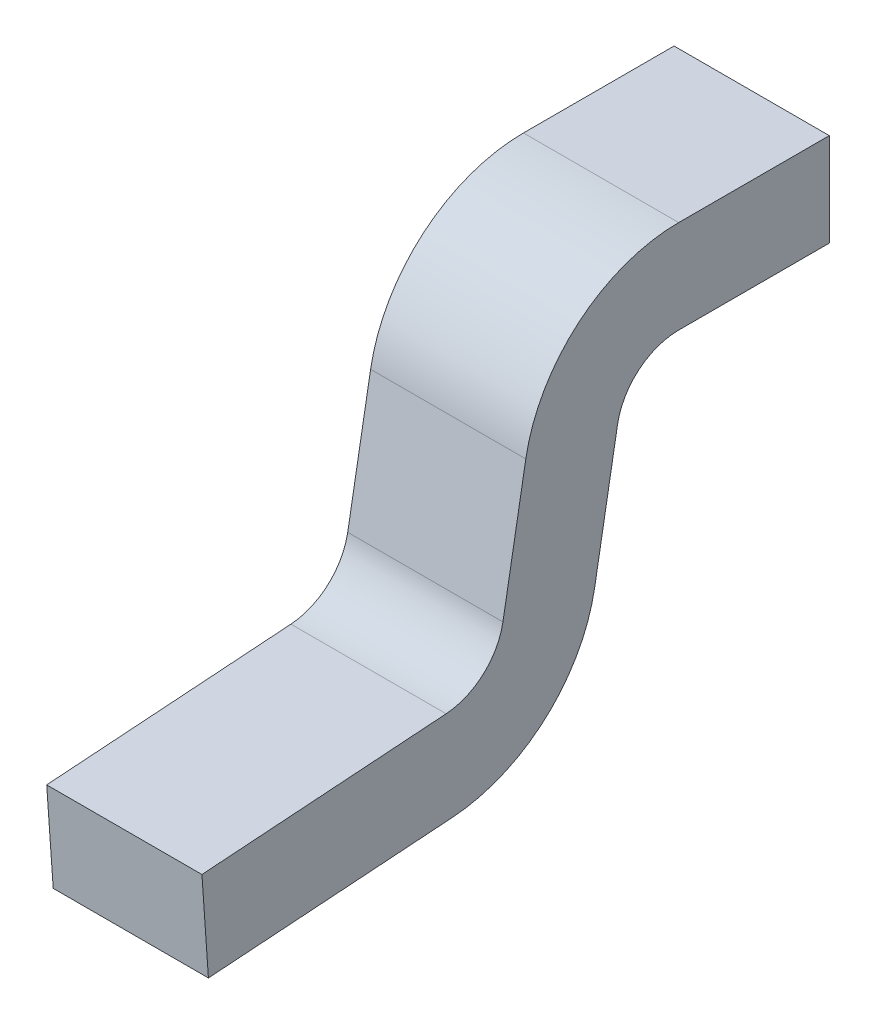
ISO-10303-21;
HEADER;
FILE_DESCRIPTION(('STEP AP214'),'2;1');
FILE_NAME('part.step','',(''),(''),'','','');
FILE_SCHEMA(('AUTOMOTIVE_DESIGN { 1 0 10303 214 1 1 1 1 }'));
ENDSEC;
DATA;
#1=APPLICATION_CONTEXT('core data for automotive mechanical design processes');
#2=APPLICATION_PROTOCOL_DEFINITION('international standard','automotive_design',2000,#1);
#3=PRODUCT_CONTEXT('',#1,'mechanical');
#4=PRODUCT('Part','Part','',(#3));
#5=PRODUCT_RELATED_PRODUCT_CATEGORY('part','',(#4));
#6=PRODUCT_DEFINITION_FORMATION('','',#4);
#7=PRODUCT_DEFINITION_CONTEXT('part definition',#1,'design');
#8=PRODUCT_DEFINITION('design','',#6,#7);
#9=PRODUCT_DEFINITION_SHAPE('','',#8);
#10=(LENGTH_UNIT() NAMED_UNIT(*) SI_UNIT(.MILLI.,.METRE.));
#11=(NAMED_UNIT(*) PLANE_ANGLE_UNIT() SI_UNIT($,.RADIAN.));
#12=(NAMED_UNIT(*) SI_UNIT($,.STERADIAN.) SOLID_ANGLE_UNIT());
#13=UNCERTAINTY_MEASURE_WITH_UNIT(LENGTH_MEASURE(1.E-05),#10,'distance_accuracy_value','');
#14=(GEOMETRIC_REPRESENTATION_CONTEXT(3) GLOBAL_UNCERTAINTY_ASSIGNED_CONTEXT((#13)) GLOBAL_UNIT_ASSIGNED_CONTEXT((#10,
#11,#12)) REPRESENTATION_CONTEXT('',''));
#15=CARTESIAN_POINT('',(0.,0.,0.));
#16=DIRECTION('',(0.,0.,1.));
#17=DIRECTION('',(1.,0.,0.));
#18=AXIS2_PLACEMENT_3D('',#15,#16,#17);
#19=CARTESIAN_POINT('',(0.125,0.,0.));
#20=DIRECTION('',(1.,0.,0.));
#21=DIRECTION('',(0.,0.,-1.));
#22=AXIS2_PLACEMENT_3D('',#19,#20,#21);
#23=PLANE('',#22);
#24=DIRECTION('',(0.,0.,1.));
#25=VECTOR('',#24,1.);
#26=CARTESIAN_POINT('',(0.125,0.425,-0.375));
#27=LINE('',#26,#25);
#28=CARTESIAN_POINT('',(0.125,0.425,-0.132399882813));
#29=VERTEX_POINT('',#28);
#30=CARTESIAN_POINT('',(0.125,0.425,-0.375));
#31=VERTEX_POINT('',#30);
#32=EDGE_CURVE('E116',#29,#31,#27,.F.);
#33=ORIENTED_EDGE('',*,*,#32,.F.);
#34=CARTESIAN_POINT('',(0.125,0.175,-0.132399882813));
#35=DIRECTION('',(-1.,0.,0.));
#36=DIRECTION('',(0.,0.,1.));
#37=AXIS2_PLACEMENT_3D('',#34,#35,#36);
#38=CIRCLE('',#37,0.25);
#39=CARTESIAN_POINT('',(0.125,0.218412044416895,0.113802055440616));
#40=VERTEX_POINT('',#39);
#41=EDGE_CURVE('E20',#40,#29,#38,.T.);
#42=ORIENTED_EDGE('',*,*,#41,.F.);
#43=DIRECTION('',(0.,-0.98480775301219,0.173648177667033));
#44=VECTOR('',#43,1.);
#45=CARTESIAN_POINT('',(0.125,0.02604722665004,0.147721162952));
#46=LINE('',#45,#44);
#47=CARTESIAN_POINT('',(0.125,0.00953014220122148,0.150633570582874));
#48=VERTEX_POINT('',#47);
#49=EDGE_CURVE('E101',#48,#40,#46,.F.);
#50=ORIENTED_EDGE('',*,*,#49,.F.);
#51=CARTESIAN_POINT('',(0.125,0.02689495996792,0.249114345884));
#52=DIRECTION('',(1.,0.,0.));
#53=DIRECTION('',(0.,0.,-1.));
#54=AXIS2_PLACEMENT_3D('',#51,#52,#53);
#55=CIRCLE('',#54,0.1);
#56=CARTESIAN_POINT('',(0.125,-0.0728614450580581,0.242138698509794));
#57=VERTEX_POINT('',#56);
#58=EDGE_CURVE('E124',#48,#57,#55,.F.);
#59=ORIENTED_EDGE('',*,*,#58,.T.);
#60=DIRECTION('',(0.,-0.0697564737441177,0.997564050259825));
#61=VECTOR('',#60,1.);
#62=CARTESIAN_POINT('',(0.125,-0.06741147202885,0.164200453111));
#63=LINE('',#62,#61);
#64=CARTESIAN_POINT('',(0.125,-0.100365392461012,0.635463471061999));
#65=VERTEX_POINT('',#64);
#66=EDGE_CURVE('E157',#65,#57,#63,.F.);
#67=ORIENTED_EDGE('',*,*,#66,.F.);
#68=DIRECTION('',(0.,-0.997564050259825,-0.0697564737441177));
#69=VECTOR('',#68,1.);
#70=CARTESIAN_POINT('',(0.125,-0.100365392461,0.635463471062));
#71=LINE('',#70,#69);
#72=CARTESIAN_POINT('',(0.125,-0.250000000000009,0.625000000000126));
#73=VERTEX_POINT('',#72);
#74=EDGE_CURVE('E152',#73,#65,#71,.F.);
#75=ORIENTED_EDGE('',*,*,#74,.F.);
#76=DIRECTION('',(0.,0.0697564737441177,-0.997564050259825));
#77=VECTOR('',#76,1.);
#78=CARTESIAN_POINT('',(0.125,-0.25,0.625));
#79=LINE('',#78,#77);
#80=CARTESIAN_POINT('',(0.125,-0.222496052597036,0.231675227447984));
#81=VERTEX_POINT('',#80);
#82=EDGE_CURVE('E146',#81,#73,#79,.F.);
#83=ORIENTED_EDGE('',*,*,#82,.F.);
#84=CARTESIAN_POINT('',(0.125,0.02689495996792,0.249114345884));
#85=DIRECTION('',(-1.,0.,0.));
#86=DIRECTION('',(0.,0.,1.));
#87=AXIS2_PLACEMENT_3D('',#84,#85,#86);
#88=CIRCLE('',#87,0.25);
#89=CARTESIAN_POINT('',(0.125,-0.0165170844488257,0.00291240763095006));
#90=VERTEX_POINT('',#89);
#91=EDGE_CURVE('E180',#90,#81,#88,.T.);
#92=ORIENTED_EDGE('',*,*,#91,.F.);
#93=DIRECTION('',(0.,0.98480775301219,-0.173648177667033));
#94=VECTOR('',#93,1.);
#95=CARTESIAN_POINT('',(0.125,-0.208871120024,0.03682961395103));
#96=LINE('',#95,#94);
#97=CARTESIAN_POINT('',(0.125,0.192364817766844,-0.0339191075116041));
#98=VERTEX_POINT('',#97);
#99=EDGE_CURVE('E142',#98,#90,#96,.F.);
#100=ORIENTED_EDGE('',*,*,#99,.F.);
#101=CARTESIAN_POINT('',(0.125,0.175,-0.132399882813));
#102=DIRECTION('',(-1.,0.,0.));
#103=DIRECTION('',(0.,0.,1.));
#104=AXIS2_PLACEMENT_3D('',#101,#102,#103);
#105=CIRCLE('',#104,0.1);
#106=CARTESIAN_POINT('',(0.125,0.275,-0.132399882813));
#107=VERTEX_POINT('',#106);
#108=EDGE_CURVE('E139',#98,#107,#105,.T.);
#109=ORIENTED_EDGE('',*,*,#108,.T.);
#110=DIRECTION('',(0.,0.,-1.));
#111=VECTOR('',#110,1.);
#112=CARTESIAN_POINT('',(0.125,0.275,-0.04848991969483));
#113=LINE('',#112,#111);
#114=CARTESIAN_POINT('',(0.125,0.275,-0.375));
#115=VERTEX_POINT('',#114);
#116=EDGE_CURVE('E137',#115,#107,#113,.F.);
#117=ORIENTED_EDGE('',*,*,#116,.F.);
#118=DIRECTION('',(0.,1.,0.));
#119=VECTOR('',#118,1.);
#120=CARTESIAN_POINT('',(0.125,0.275,-0.375));
#121=LINE('',#120,#119);
#122=EDGE_CURVE('E132',#31,#115,#121,.F.);
#123=ORIENTED_EDGE('',*,*,#122,.F.);
#124=EDGE_LOOP('',(#33,#42,#50,#59,#67,#75,#83,#92,#100,#109,#117,#123));
#125=FACE_BOUND('',#124,.T.);
#126=ADVANCED_FACE('F17',(#125),#23,.T.);
#127=CARTESIAN_POINT('',(0.4509,0.175,-0.132399882813));
#128=DIRECTION('',(-1.,0.,0.));
#129=DIRECTION('',(0.,0.,1.));
#130=AXIS2_PLACEMENT_3D('',#127,#128,#129);
#131=CYLINDRICAL_SURFACE('',#130,0.25);
#132=DIRECTION('',(1.,0.,0.));
#133=VECTOR('',#132,1.);
#134=CARTESIAN_POINT('',(-0.125,0.425,-0.132399882813));
#135=LINE('',#134,#133);
#136=CARTESIAN_POINT('',(-0.125,0.425,-0.132399882813));
#137=VERTEX_POINT('',#136);
#138=EDGE_CURVE('E176',#137,#29,#135,.T.);
#139=ORIENTED_EDGE('',*,*,#138,.F.);
#140=CARTESIAN_POINT('',(-0.125,0.175,-0.132399882813));
#141=DIRECTION('',(-1.,0.,0.));
#142=DIRECTION('',(0.,0.,1.));
#143=AXIS2_PLACEMENT_3D('',#140,#141,#142);
#144=CIRCLE('',#143,0.25);
#145=CARTESIAN_POINT('',(-0.125,0.218412044416719,0.113802055440848));
#146=VERTEX_POINT('',#145);
#147=EDGE_CURVE('E122',#137,#146,#144,.F.);
#148=ORIENTED_EDGE('',*,*,#147,.T.);
#149=DIRECTION('',(1.,0.,0.));
#150=VECTOR('',#149,1.);
#151=CARTESIAN_POINT('',(-0.125,0.218412044416931,0.113802055440609));
#152=LINE('',#151,#150);
#153=EDGE_CURVE('E106',#40,#146,#152,.F.);
#154=ORIENTED_EDGE('',*,*,#153,.F.);
#155=ORIENTED_EDGE('',*,*,#41,.T.);
#156=EDGE_LOOP('',(#139,#148,#154,#155));
#157=FACE_BOUND('',#156,.T.);
#158=ADVANCED_FACE('F121',(#157),#131,.T.);
#159=CARTESIAN_POINT('',(-0.125,0.02604722665004,0.147721162952));
#160=DIRECTION('',(0.,0.173648177667033,0.98480775301219));
#161=DIRECTION('',(0.,-0.98480775301219,0.173648177667033));
#162=AXIS2_PLACEMENT_3D('',#159,#160,#161);
#163=PLANE('',#162);
#164=ORIENTED_EDGE('',*,*,#49,.T.);
#165=ORIENTED_EDGE('',*,*,#153,.T.);
#166=DIRECTION('',(0.,-0.984807753012488,0.173648177665343));
#167=VECTOR('',#166,1.);
#168=CARTESIAN_POINT('',(-0.125,0.218412044417,0.113802055441));
#169=LINE('',#168,#167);
#170=CARTESIAN_POINT('',(-0.125,0.00953014220130885,0.150633570582876));
#171=VERTEX_POINT('',#170);
#172=EDGE_CURVE('E174',#146,#171,#169,.T.);
#173=ORIENTED_EDGE('',*,*,#172,.T.);
#174=DIRECTION('',(1.,0.,0.));
#175=VECTOR('',#174,1.);
#176=CARTESIAN_POINT('',(-0.125,0.00953014220119408,0.150633570582785));
#177=LINE('',#176,#175);
#178=EDGE_CURVE('E108',#171,#48,#177,.T.);
#179=ORIENTED_EDGE('',*,*,#178,.T.);
#180=EDGE_LOOP('',(#164,#165,#173,#179));
#181=FACE_BOUND('',#180,.T.);
#182=ADVANCED_FACE('F103',(#181),#163,.T.);
#183=CARTESIAN_POINT('',(-0.125,0.02689495996792,0.249114345884));
#184=DIRECTION('',(1.,0.,0.));
#185=DIRECTION('',(0.,0.,-1.));
#186=AXIS2_PLACEMENT_3D('',#183,#184,#185);
#187=CYLINDRICAL_SURFACE('',#186,0.1);
#188=ORIENTED_EDGE('',*,*,#178,.F.);
#189=CARTESIAN_POINT('',(-0.125,0.02689495996792,0.249114345884));
#190=DIRECTION('',(1.,0.,0.));
#191=DIRECTION('',(0.,0.,-1.));
#192=AXIS2_PLACEMENT_3D('',#189,#190,#191);
#193=CIRCLE('',#192,0.1);
#194=CARTESIAN_POINT('',(-0.125,-0.0728614450580521,0.242138698509798));
#195=VERTEX_POINT('',#194);
#196=EDGE_CURVE('E170',#171,#195,#193,.F.);
#197=ORIENTED_EDGE('',*,*,#196,.T.);
#198=DIRECTION('',(1.,0.,0.));
#199=VECTOR('',#198,1.);
#200=CARTESIAN_POINT('',(-0.125,-0.0728614450580724,0.242138698509999));
#201=LINE('',#200,#199);
#202=EDGE_CURVE('E154',#57,#195,#201,.F.);
#203=ORIENTED_EDGE('',*,*,#202,.F.);
#204=ORIENTED_EDGE('',*,*,#58,.F.);
#205=EDGE_LOOP('',(#188,#197,#203,#204));
#206=FACE_BOUND('',#205,.T.);
#207=ADVANCED_FACE('F186',(#206),#187,.F.);
#208=CARTESIAN_POINT('',(-0.125,-0.06741147202885,0.164200453111));
#209=DIRECTION('',(0.,0.997564050259825,0.0697564737441177));
#210=DIRECTION('',(0.,-0.0697564737441177,0.997564050259825));
#211=AXIS2_PLACEMENT_3D('',#208,#209,#210);
#212=PLANE('',#211);
#213=ORIENTED_EDGE('',*,*,#202,.T.);
#214=DIRECTION('',(0.,-0.0697564737440553,0.997564050259829));
#215=VECTOR('',#214,1.);
#216=CARTESIAN_POINT('',(-0.125,-0.07286144505806,0.24213869851));
#217=LINE('',#216,#215);
#218=CARTESIAN_POINT('',(-0.125,-0.100365392461,0.635463471062));
#219=VERTEX_POINT('',#218);
#220=EDGE_CURVE('E173',#195,#219,#217,.T.);
#221=ORIENTED_EDGE('',*,*,#220,.T.);
#222=DIRECTION('',(1.,0.,0.));
#223=VECTOR('',#222,1.);
#224=CARTESIAN_POINT('',(-0.125,-0.100365392461,0.635463471062));
#225=LINE('',#224,#223);
#226=EDGE_CURVE('E149',#65,#219,#225,.F.);
#227=ORIENTED_EDGE('',*,*,#226,.F.);
#228=ORIENTED_EDGE('',*,*,#66,.T.);
#229=EDGE_LOOP('',(#213,#221,#227,#228));
#230=FACE_BOUND('',#229,.T.);
#231=ADVANCED_FACE('F263',(#230),#212,.T.);
#232=CARTESIAN_POINT('',(-0.125,-0.100365392461,0.635463471062));
#233=DIRECTION('',(0.,-0.0697564737441177,0.997564050259825));
#234=DIRECTION('',(0.,-0.997564050259825,-0.0697564737441177));
#235=AXIS2_PLACEMENT_3D('',#232,#233,#234);
#236=PLANE('',#235);
#237=ORIENTED_EDGE('',*,*,#226,.T.);
#238=DIRECTION('',(0.,-0.997564050259648,-0.0697564737466421));
#239=VECTOR('',#238,1.);
#240=CARTESIAN_POINT('',(-0.125,-0.100365392461,0.635463471062));
#241=LINE('',#240,#239);
#242=CARTESIAN_POINT('',(-0.125,-0.25,0.625));
#243=VERTEX_POINT('',#242);
#244=EDGE_CURVE('E197',#219,#243,#241,.T.);
#245=ORIENTED_EDGE('',*,*,#244,.T.);
#246=DIRECTION('',(1.,0.,0.));
#247=VECTOR('',#246,1.);
#248=CARTESIAN_POINT('',(-0.125,-0.25,0.625));
#249=LINE('',#248,#247);
#250=EDGE_CURVE('E148',#73,#243,#249,.F.);
#251=ORIENTED_EDGE('',*,*,#250,.F.);
#252=ORIENTED_EDGE('',*,*,#74,.T.);
#253=EDGE_LOOP('',(#237,#245,#251,#252));
#254=FACE_BOUND('',#253,.T.);
#255=ADVANCED_FACE('F262',(#254),#236,.T.);
#256=CARTESIAN_POINT('',(-0.125,-0.25,0.625));
#257=DIRECTION('',(0.,-0.997564050259825,-0.0697564737441177));
#258=DIRECTION('',(0.,0.0697564737441177,-0.997564050259825));
#259=AXIS2_PLACEMENT_3D('',#256,#257,#258);
#260=PLANE('',#259);
#261=ORIENTED_EDGE('',*,*,#250,.T.);
#262=DIRECTION('',(0.,0.0697564737442068,-0.997564050259819));
#263=VECTOR('',#262,1.);
#264=CARTESIAN_POINT('',(-0.125,-0.25,0.625));
#265=LINE('',#264,#263);
#266=CARTESIAN_POINT('',(-0.125,-0.222496052597017,0.231675227447974));
#267=VERTEX_POINT('',#266);
#268=EDGE_CURVE('E169',#243,#267,#265,.T.);
#269=ORIENTED_EDGE('',*,*,#268,.T.);
#270=DIRECTION('',(-1.,0.,0.));
#271=VECTOR('',#270,1.);
#272=CARTESIAN_POINT('',(-0.125,-0.222496052597038,0.231675227447997));
#273=LINE('',#272,#271);
#274=EDGE_CURVE('E145',#81,#267,#273,.T.);
#275=ORIENTED_EDGE('',*,*,#274,.F.);
#276=ORIENTED_EDGE('',*,*,#82,.T.);
#277=EDGE_LOOP('',(#261,#269,#275,#276));
#278=FACE_BOUND('',#277,.T.);
#279=ADVANCED_FACE('F258',(#278),#260,.T.);
#280=CARTESIAN_POINT('',(-0.125,0.02689495996792,0.249114345884));
#281=DIRECTION('',(-1.,0.,0.));
#282=DIRECTION('',(0.,0.,1.));
#283=AXIS2_PLACEMENT_3D('',#280,#281,#282);
#284=CYLINDRICAL_SURFACE('',#283,0.25);
#285=CARTESIAN_POINT('',(-0.125,0.02689495996792,0.249114345884));
#286=DIRECTION('',(-1.,0.,0.));
#287=DIRECTION('',(0.,0.,1.));
#288=AXIS2_PLACEMENT_3D('',#285,#286,#287);
#289=CIRCLE('',#288,0.25);
#290=CARTESIAN_POINT('',(-0.125,-0.0165170844487829,0.00291240763095142));
#291=VERTEX_POINT('',#290);
#292=EDGE_CURVE('E166',#267,#291,#289,.F.);
#293=ORIENTED_EDGE('',*,*,#292,.T.);
#294=DIRECTION('',(1.,0.,0.));
#295=VECTOR('',#294,1.);
#296=CARTESIAN_POINT('',(-0.125,-0.016517084448813,0.00291240763094784));
#297=LINE('',#296,#295);
#298=EDGE_CURVE('E144',#90,#291,#297,.F.);
#299=ORIENTED_EDGE('',*,*,#298,.F.);
#300=ORIENTED_EDGE('',*,*,#91,.T.);
#301=ORIENTED_EDGE('',*,*,#274,.T.);
#302=EDGE_LOOP('',(#293,#299,#300,#301));
#303=FACE_BOUND('',#302,.T.);
#304=ADVANCED_FACE('F254',(#303),#284,.T.);
#305=CARTESIAN_POINT('',(-0.125,-0.208871120024,0.03682961395103));
#306=DIRECTION('',(0.,-0.173648177667033,-0.98480775301219));
#307=DIRECTION('',(0.,0.98480775301219,-0.173648177667033));
#308=AXIS2_PLACEMENT_3D('',#305,#306,#307);
#309=PLANE('',#308);
#310=DIRECTION('',(0.,0.984807753012248,-0.173648177666704));
#311=VECTOR('',#310,1.);
#312=CARTESIAN_POINT('',(-0.125,-0.01651708444881,0.002912407630965));
#313=LINE('',#312,#311);
#314=CARTESIAN_POINT('',(-0.125,0.192364817766835,-0.0339191075115576));
#315=VERTEX_POINT('',#314);
#316=EDGE_CURVE('E165',#291,#315,#313,.T.);
#317=ORIENTED_EDGE('',*,*,#316,.T.);
#318=DIRECTION('',(-1.,0.,0.));
#319=VECTOR('',#318,1.);
#320=CARTESIAN_POINT('',(0.4509,0.192364817766916,-0.0339191075118185));
#321=LINE('',#320,#319);
#322=EDGE_CURVE('E179',#315,#98,#321,.F.);
#323=ORIENTED_EDGE('',*,*,#322,.T.);
#324=ORIENTED_EDGE('',*,*,#99,.T.);
#325=ORIENTED_EDGE('',*,*,#298,.T.);
#326=EDGE_LOOP('',(#317,#323,#324,#325));
#327=FACE_BOUND('',#326,.T.);
#328=ADVANCED_FACE('F248',(#327),#309,.T.);
#329=CARTESIAN_POINT('',(0.4509,0.175,-0.132399882813));
#330=DIRECTION('',(-1.,0.,0.));
#331=DIRECTION('',(0.,0.,1.));
#332=AXIS2_PLACEMENT_3D('',#329,#330,#331);
#333=CYLINDRICAL_SURFACE('',#332,0.1);
#334=DIRECTION('',(1.,0.,0.));
#335=VECTOR('',#334,1.);
#336=CARTESIAN_POINT('',(-0.125,0.275,-0.132399882813));
#337=LINE('',#336,#335);
#338=CARTESIAN_POINT('',(-0.125,0.275,-0.132399882813));
#339=VERTEX_POINT('',#338);
#340=EDGE_CURVE('E134',#107,#339,#337,.F.);
#341=ORIENTED_EDGE('',*,*,#340,.F.);
#342=ORIENTED_EDGE('',*,*,#108,.F.);
#343=ORIENTED_EDGE('',*,*,#322,.F.);
#344=CARTESIAN_POINT('',(-0.125,0.175,-0.132399882813));
#345=DIRECTION('',(-1.,0.,0.));
#346=DIRECTION('',(0.,0.,1.));
#347=AXIS2_PLACEMENT_3D('',#344,#345,#346);
#348=CIRCLE('',#347,0.1);
#349=EDGE_CURVE('E161',#315,#339,#348,.T.);
#350=ORIENTED_EDGE('',*,*,#349,.T.);
#351=EDGE_LOOP('',(#341,#342,#343,#350));
#352=FACE_BOUND('',#351,.T.);
#353=ADVANCED_FACE('F245',(#352),#333,.F.);
#354=CARTESIAN_POINT('',(-0.125,0.275,-0.04848991969483));
#355=DIRECTION('',(0.,-1.,0.));
#356=DIRECTION('',(0.,0.,-1.));
#357=AXIS2_PLACEMENT_3D('',#354,#355,#356);
#358=PLANE('',#357);
#359=ORIENTED_EDGE('',*,*,#116,.T.);
#360=ORIENTED_EDGE('',*,*,#340,.T.);
#361=DIRECTION('',(0.,0.,-1.));
#362=VECTOR('',#361,1.);
#363=CARTESIAN_POINT('',(-0.125,0.275,0.));
#364=LINE('',#363,#362);
#365=CARTESIAN_POINT('',(-0.125,0.275,-0.375));
#366=VERTEX_POINT('',#365);
#367=EDGE_CURVE('E164',#339,#366,#364,.T.);
#368=ORIENTED_EDGE('',*,*,#367,.T.);
#369=DIRECTION('',(-1.,0.,0.));
#370=VECTOR('',#369,1.);
#371=CARTESIAN_POINT('',(-0.125,0.275,-0.375));
#372=LINE('',#371,#370);
#373=EDGE_CURVE('E129',#115,#366,#372,.T.);
#374=ORIENTED_EDGE('',*,*,#373,.F.);
#375=EDGE_LOOP('',(#359,#360,#368,#374));
#376=FACE_BOUND('',#375,.T.);
#377=ADVANCED_FACE('F237',(#376),#358,.T.);
#378=CARTESIAN_POINT('',(-0.125,0.275,-0.375));
#379=DIRECTION('',(0.,0.,-1.));
#380=DIRECTION('',(-1.,0.,0.));
#381=AXIS2_PLACEMENT_3D('',#378,#379,#380);
#382=PLANE('',#381);
#383=ORIENTED_EDGE('',*,*,#373,.T.);
#384=DIRECTION('',(0.,1.,0.));
#385=VECTOR('',#384,1.);
#386=CARTESIAN_POINT('',(-0.125,0.,-0.375));
#387=LINE('',#386,#385);
#388=CARTESIAN_POINT('',(-0.125,0.425,-0.375));
#389=VERTEX_POINT('',#388);
#390=EDGE_CURVE('E26',#366,#389,#387,.T.);
#391=ORIENTED_EDGE('',*,*,#390,.T.);
#392=DIRECTION('',(1.,0.,0.));
#393=VECTOR('',#392,1.);
#394=CARTESIAN_POINT('',(-0.125,0.425,-0.375));
#395=LINE('',#394,#393);
#396=EDGE_CURVE('E34',#31,#389,#395,.F.);
#397=ORIENTED_EDGE('',*,*,#396,.F.);
#398=ORIENTED_EDGE('',*,*,#122,.T.);
#399=EDGE_LOOP('',(#383,#391,#397,#398));
#400=FACE_BOUND('',#399,.T.);
#401=ADVANCED_FACE('F266',(#400),#382,.T.);
#402=CARTESIAN_POINT('',(-0.125,0.425,-0.375));
#403=DIRECTION('',(0.,1.,0.));
#404=DIRECTION('',(0.,0.,1.));
#405=AXIS2_PLACEMENT_3D('',#402,#403,#404);
#406=PLANE('',#405);
#407=DIRECTION('',(0.,0.,-1.));
#408=VECTOR('',#407,1.);
#409=CARTESIAN_POINT('',(-0.125,0.425,0.));
#410=LINE('',#409,#408);
#411=EDGE_CURVE('E11',#389,#137,#410,.F.);
#412=ORIENTED_EDGE('',*,*,#411,.T.);
#413=ORIENTED_EDGE('',*,*,#138,.T.);
#414=ORIENTED_EDGE('',*,*,#32,.T.);
#415=ORIENTED_EDGE('',*,*,#396,.T.);
#416=EDGE_LOOP('',(#412,#413,#414,#415));
#417=FACE_BOUND('',#416,.T.);
#418=ADVANCED_FACE('F264',(#417),#406,.T.);
#419=CARTESIAN_POINT('',(-0.125,0.,0.));
#420=DIRECTION('',(1.,0.,0.));
#421=DIRECTION('',(0.,0.,-1.));
#422=AXIS2_PLACEMENT_3D('',#419,#420,#421);
#423=PLANE('',#422);
#424=ORIENTED_EDGE('',*,*,#390,.F.);
#425=ORIENTED_EDGE('',*,*,#367,.F.);
#426=ORIENTED_EDGE('',*,*,#349,.F.);
#427=ORIENTED_EDGE('',*,*,#316,.F.);
#428=ORIENTED_EDGE('',*,*,#292,.F.);
#429=ORIENTED_EDGE('',*,*,#268,.F.);
#430=ORIENTED_EDGE('',*,*,#244,.F.);
#431=ORIENTED_EDGE('',*,*,#220,.F.);
#432=ORIENTED_EDGE('',*,*,#196,.F.);
#433=ORIENTED_EDGE('',*,*,#172,.F.);
#434=ORIENTED_EDGE('',*,*,#147,.F.);
#435=ORIENTED_EDGE('',*,*,#411,.F.);
#436=EDGE_LOOP('',(#424,#425,#426,#427,#428,#429,#430,#431,#432,#433,#434,#435));
#437=FACE_BOUND('',#436,.T.);
#438=ADVANCED_FACE('F242',(#437),#423,.F.);
#439=CLOSED_SHELL('',(#126,#158,#182,#207,#231,#255,#279,#304,#328,#353,#377,#401,#418,#438));
#440=MANIFOLD_SOLID_BREP('B1',#439);
#441=ADVANCED_BREP_SHAPE_REPRESENTATION('',(#18,#440),#14);
#442=SHAPE_DEFINITION_REPRESENTATION(#9,#441);
ENDSEC;
END-ISO-10303-21;
